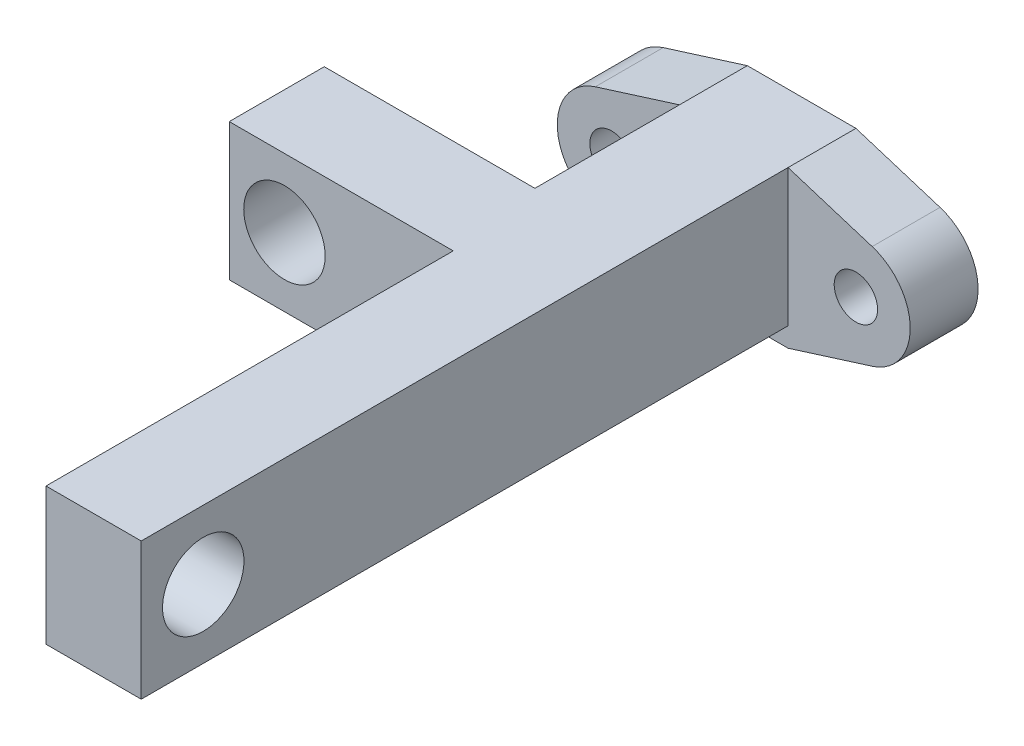
ISO-10303-21;
HEADER;
FILE_DESCRIPTION(('STEP AP214'),'2;1');
FILE_NAME('part.step','',(''),(''),'','','');
FILE_SCHEMA(('AUTOMOTIVE_DESIGN { 1 0 10303 214 1 1 1 1 }'));
ENDSEC;
DATA;
#1=APPLICATION_CONTEXT('core data for automotive mechanical design processes');
#2=APPLICATION_PROTOCOL_DEFINITION('international standard','automotive_design',2000,#1);
#3=PRODUCT_CONTEXT('',#1,'mechanical');
#4=PRODUCT('Part','Part','',(#3));
#5=PRODUCT_RELATED_PRODUCT_CATEGORY('part','',(#4));
#6=PRODUCT_DEFINITION_FORMATION('','',#4);
#7=PRODUCT_DEFINITION_CONTEXT('part definition',#1,'design');
#8=PRODUCT_DEFINITION('design','',#6,#7);
#9=PRODUCT_DEFINITION_SHAPE('','',#8);
#10=(LENGTH_UNIT() NAMED_UNIT(*) SI_UNIT(.MILLI.,.METRE.));
#11=(NAMED_UNIT(*) PLANE_ANGLE_UNIT() SI_UNIT($,.RADIAN.));
#12=(NAMED_UNIT(*) SI_UNIT($,.STERADIAN.) SOLID_ANGLE_UNIT());
#13=UNCERTAINTY_MEASURE_WITH_UNIT(LENGTH_MEASURE(1.E-05),#10,'distance_accuracy_value','');
#14=(GEOMETRIC_REPRESENTATION_CONTEXT(3) GLOBAL_UNCERTAINTY_ASSIGNED_CONTEXT((#13)) GLOBAL_UNIT_ASSIGNED_CONTEXT((#10,
#11,#12)) REPRESENTATION_CONTEXT('',''));
#15=CARTESIAN_POINT('',(0.,0.,0.));
#16=DIRECTION('',(0.,0.,1.));
#17=DIRECTION('',(1.,0.,0.));
#18=AXIS2_PLACEMENT_3D('',#15,#16,#17);
#19=CARTESIAN_POINT('',(-4.00000018998981,-4.33450474942276,22.6500000000004));
#20=DIRECTION('',(1.,0.,0.));
#21=DIRECTION('',(0.,0.,-1.));
#22=AXIS2_PLACEMENT_3D('',#19,#20,#21);
#23=PLANE('',#22);
#24=DIRECTION('',(0.,-1.,0.));
#25=VECTOR('',#24,1.);
#26=CARTESIAN_POINT('',(-4.00000018998981,5.76300080865621,15.6500000000005));
#27=LINE('',#26,#25);
#28=CARTESIAN_POINT('',(-4.00000018998981,5.76300080865621,15.6500000000005));
#29=VERTEX_POINT('',#28);
#30=CARTESIAN_POINT('',(-4.00000018998981,-4.33450474942276,15.6500000000005));
#31=VERTEX_POINT('',#30);
#32=EDGE_CURVE('E185',#29,#31,#27,.T.);
#33=ORIENTED_EDGE('',*,*,#32,.F.);
#34=DIRECTION('',(0.,0.,-1.));
#35=VECTOR('',#34,1.);
#36=CARTESIAN_POINT('',(-4.00000018998981,5.76300080865622,22.6500000000004));
#37=LINE('',#36,#35);
#38=CARTESIAN_POINT('',(-4.00000018998981,5.76300080865622,5.));
#39=VERTEX_POINT('',#38);
#40=EDGE_CURVE('E153',#29,#39,#37,.T.);
#41=ORIENTED_EDGE('',*,*,#40,.T.);
#42=DIRECTION('',(0.,-1.,0.));
#43=VECTOR('',#42,1.);
#44=CARTESIAN_POINT('',(-4.00000018998981,-4.33450474942276,5.));
#45=LINE('',#44,#43);
#46=CARTESIAN_POINT('',(-4.00000018998981,-4.33450474942276,5.));
#47=VERTEX_POINT('',#46);
#48=EDGE_CURVE('E209',#39,#47,#45,.T.);
#49=ORIENTED_EDGE('',*,*,#48,.T.);
#50=DIRECTION('',(0.,0.,-1.));
#51=VECTOR('',#50,1.);
#52=CARTESIAN_POINT('',(-4.00000018998981,-4.33450474942276,22.6500000000004));
#53=LINE('',#52,#51);
#54=EDGE_CURVE('E214',#31,#47,#53,.T.);
#55=ORIENTED_EDGE('',*,*,#54,.F.);
#56=EDGE_LOOP('',(#33,#41,#49,#55));
#57=FACE_BOUND('',#56,.T.);
#58=ADVANCED_FACE('F35',(#57),#23,.F.);
#59=CARTESIAN_POINT('',(-9.00014511895117,-0.00106902473267904,5.));
#60=DIRECTION('',(0.,0.,1.));
#61=DIRECTION('',(1.,0.,0.));
#62=AXIS2_PLACEMENT_3D('',#59,#60,#61);
#63=PLANE('',#62);
#64=DIRECTION('',(0.,1.,0.));
#65=VECTOR('',#64,1.);
#66=CARTESIAN_POINT('',(4.00000018998981,-4.33450474942276,5.));
#67=LINE('',#66,#65);
#68=CARTESIAN_POINT('',(4.00000018998981,-4.33450474942276,5.));
#69=VERTEX_POINT('',#68);
#70=CARTESIAN_POINT('',(4.00000018998981,5.76300080865622,5.));
#71=VERTEX_POINT('',#70);
#72=EDGE_CURVE('E59',#69,#71,#67,.T.);
#73=ORIENTED_EDGE('',*,*,#72,.F.);
#74=DIRECTION('',(1.,0.,0.));
#75=VECTOR('',#74,1.);
#76=CARTESIAN_POINT('',(4.00000018998981,-4.33450474942276,5.));
#77=LINE('',#76,#75);
#78=EDGE_CURVE('E205',#47,#69,#77,.T.);
#79=ORIENTED_EDGE('',*,*,#78,.F.);
#80=ORIENTED_EDGE('',*,*,#48,.F.);
#81=DIRECTION('',(-0.954029129539832,-0.299713896890804,0.));
#82=VECTOR('',#81,1.);
#83=CARTESIAN_POINT('',(-4.00000018998981,5.76300080865622,5.));
#84=LINE('',#83,#82);
#85=CARTESIAN_POINT('',(-10.1991438510935,3.8155031416285,5.));
#86=VERTEX_POINT('',#85);
#87=EDGE_CURVE('E243',#39,#86,#84,.T.);
#88=ORIENTED_EDGE('',*,*,#87,.T.);
#89=CARTESIAN_POINT('',(-9.00014511895117,-0.00106902473267904,5.));
#90=DIRECTION('',(0.,0.,1.));
#91=DIRECTION('',(1.,0.,0.));
#92=AXIS2_PLACEMENT_3D('',#89,#90,#91);
#93=CIRCLE('',#92,4.00047760407701);
#94=CARTESIAN_POINT('',(-10.1990659794877,-3.81766565404682,5.));
#95=VERTEX_POINT('',#94);
#96=EDGE_CURVE('E229',#86,#95,#93,.T.);
#97=ORIENTED_EDGE('',*,*,#96,.T.);
#98=DIRECTION('',(0.954035244547933,-0.299694431313572,0.));
#99=VECTOR('',#98,1.);
#100=CARTESIAN_POINT('',(-10.1990659794877,-3.81766565404682,5.));
#101=LINE('',#100,#99);
#102=CARTESIAN_POINT('',(-4.00000018998981,-5.76499989256263,5.));
#103=VERTEX_POINT('',#102);
#104=EDGE_CURVE('E232',#95,#103,#101,.T.);
#105=ORIENTED_EDGE('',*,*,#104,.T.);
#106=DIRECTION('',(1.,0.,0.));
#107=VECTOR('',#106,1.);
#108=CARTESIAN_POINT('',(-4.00000018998981,-5.76499989256263,5.));
#109=LINE('',#108,#107);
#110=CARTESIAN_POINT('',(4.00000018998981,-5.76499989256263,5.));
#111=VERTEX_POINT('',#110);
#112=EDGE_CURVE('E235',#103,#111,#109,.T.);
#113=ORIENTED_EDGE('',*,*,#112,.T.);
#114=DIRECTION('',(0.954001475587167,0.299801908895704,0.));
#115=VECTOR('',#114,1.);
#116=CARTESIAN_POINT('',(4.00000018998981,-5.76499989256263,5.));
#117=LINE('',#116,#115);
#118=CARTESIAN_POINT('',(10.1977820003338,-3.81730183840964,5.));
#119=VERTEX_POINT('',#118);
#120=EDGE_CURVE('E237',#111,#119,#117,.T.);
#121=ORIENTED_EDGE('',*,*,#120,.T.);
#122=CARTESIAN_POINT('',(8.99797345167928,0.000616233074978096,5.));
#123=DIRECTION('',(0.,0.,1.));
#124=DIRECTION('',(1.,0.,0.));
#125=AXIS2_PLACEMENT_3D('',#122,#123,#124);
#126=CIRCLE('',#125,4.00200436706325);
#127=CARTESIAN_POINT('',(10.1959695758342,3.81910339954591,5.));
#128=VERTEX_POINT('',#127);
#129=EDGE_CURVE('E239',#119,#128,#126,.T.);
#130=ORIENTED_EDGE('',*,*,#129,.T.);
#131=DIRECTION('',(-0.954143678077247,0.29934902970483,0.));
#132=VECTOR('',#131,1.);
#133=CARTESIAN_POINT('',(10.1959695758342,3.81910339954591,5.));
#134=LINE('',#133,#132);
#135=EDGE_CURVE('E241',#128,#71,#134,.T.);
#136=ORIENTED_EDGE('',*,*,#135,.T.);
#137=EDGE_LOOP('',(#73,#79,#80,#88,#97,#105,#113,#121,#130,#136));
#138=FACE_BOUND('',#137,.T.);
#139=CARTESIAN_POINT('',(8.99797345167928,0.000616233074978096,5.));
#140=DIRECTION('',(0.,0.,1.));
#141=DIRECTION('',(1.,0.,0.));
#142=AXIS2_PLACEMENT_3D('',#139,#140,#141);
#143=CIRCLE('',#142,1.59816028146403);
#144=CARTESIAN_POINT('',(10.5961337331433,0.000616233074978096,5.));
#145=VERTEX_POINT('',#144);
#146=EDGE_CURVE('E223',#145,#145,#143,.T.);
#147=ORIENTED_EDGE('',*,*,#146,.F.);
#148=EDGE_LOOP('',(#147));
#149=FACE_BOUND('',#148,.T.);
#150=CARTESIAN_POINT('',(-9.00014511895117,-0.00106902473267904,5.));
#151=DIRECTION('',(0.,0.,1.));
#152=DIRECTION('',(1.,0.,0.));
#153=AXIS2_PLACEMENT_3D('',#150,#151,#152);
#154=CIRCLE('',#153,1.60099342901495);
#155=CARTESIAN_POINT('',(-7.39915168993622,-0.00106902473267904,5.));
#156=VERTEX_POINT('',#155);
#157=EDGE_CURVE('E217',#156,#156,#154,.T.);
#158=ORIENTED_EDGE('',*,*,#157,.F.);
#159=EDGE_LOOP('',(#158));
#160=FACE_BOUND('',#159,.T.);
#161=ADVANCED_FACE('F301',(#138,#149,#160),#63,.T.);
#162=CARTESIAN_POINT('',(-9.00014511895117,-0.00106902473267904,0.));
#163=DIRECTION('',(0.,0.,1.));
#164=DIRECTION('',(1.,0.,0.));
#165=AXIS2_PLACEMENT_3D('',#162,#163,#164);
#166=PLANE('',#165);
#167=CARTESIAN_POINT('',(-9.00014511895117,-0.00106902473267904,0.));
#168=DIRECTION('',(0.,0.,1.));
#169=DIRECTION('',(1.,0.,0.));
#170=AXIS2_PLACEMENT_3D('',#167,#168,#169);
#171=CIRCLE('',#170,4.00047760407701);
#172=CARTESIAN_POINT('',(-10.1991438510935,3.8155031416285,0.));
#173=VERTEX_POINT('',#172);
#174=CARTESIAN_POINT('',(-10.1990659794877,-3.81766565404682,0.));
#175=VERTEX_POINT('',#174);
#176=EDGE_CURVE('E226',#173,#175,#171,.T.);
#177=ORIENTED_EDGE('',*,*,#176,.F.);
#178=DIRECTION('',(-0.954029129539832,-0.299713896890804,0.));
#179=VECTOR('',#178,1.);
#180=CARTESIAN_POINT('',(-4.00000018998981,5.76300080865622,0.));
#181=LINE('',#180,#179);
#182=CARTESIAN_POINT('',(-4.00000018998981,5.76300080865622,0.));
#183=VERTEX_POINT('',#182);
#184=EDGE_CURVE('E233',#183,#173,#181,.T.);
#185=ORIENTED_EDGE('',*,*,#184,.F.);
#186=DIRECTION('',(-1.,0.,0.));
#187=VECTOR('',#186,1.);
#188=CARTESIAN_POINT('',(4.00000018998981,5.76300080865622,0.));
#189=LINE('',#188,#187);
#190=CARTESIAN_POINT('',(4.00000018998981,5.76300080865622,0.));
#191=VERTEX_POINT('',#190);
#192=EDGE_CURVE('E258',#191,#183,#189,.T.);
#193=ORIENTED_EDGE('',*,*,#192,.F.);
#194=DIRECTION('',(-0.954143678077247,0.29934902970483,0.));
#195=VECTOR('',#194,1.);
#196=CARTESIAN_POINT('',(10.1959695758342,3.81910339954591,0.));
#197=LINE('',#196,#195);
#198=CARTESIAN_POINT('',(10.1959695758342,3.81910339954591,0.));
#199=VERTEX_POINT('',#198);
#200=EDGE_CURVE('E256',#199,#191,#197,.T.);
#201=ORIENTED_EDGE('',*,*,#200,.F.);
#202=CARTESIAN_POINT('',(8.99797345167928,0.000616233074978096,0.));
#203=DIRECTION('',(0.,0.,1.));
#204=DIRECTION('',(1.,0.,0.));
#205=AXIS2_PLACEMENT_3D('',#202,#203,#204);
#206=CIRCLE('',#205,4.00200436706325);
#207=CARTESIAN_POINT('',(10.1977820003338,-3.81730183840964,0.));
#208=VERTEX_POINT('',#207);
#209=EDGE_CURVE('E254',#208,#199,#206,.T.);
#210=ORIENTED_EDGE('',*,*,#209,.F.);
#211=DIRECTION('',(0.954001475587167,0.299801908895704,0.));
#212=VECTOR('',#211,1.);
#213=CARTESIAN_POINT('',(4.00000018998981,-5.76499989256263,0.));
#214=LINE('',#213,#212);
#215=CARTESIAN_POINT('',(4.00000018998981,-5.76499989256263,0.));
#216=VERTEX_POINT('',#215);
#217=EDGE_CURVE('E252',#216,#208,#214,.T.);
#218=ORIENTED_EDGE('',*,*,#217,.F.);
#219=DIRECTION('',(1.,0.,0.));
#220=VECTOR('',#219,1.);
#221=CARTESIAN_POINT('',(-4.00000018998981,-5.76499989256263,0.));
#222=LINE('',#221,#220);
#223=CARTESIAN_POINT('',(-4.00000018998981,-5.76499989256263,0.));
#224=VERTEX_POINT('',#223);
#225=EDGE_CURVE('E250',#224,#216,#222,.T.);
#226=ORIENTED_EDGE('',*,*,#225,.F.);
#227=DIRECTION('',(0.954035244547933,-0.299694431313572,0.));
#228=VECTOR('',#227,1.);
#229=CARTESIAN_POINT('',(-10.1990659794877,-3.81766565404682,0.));
#230=LINE('',#229,#228);
#231=EDGE_CURVE('E248',#175,#224,#230,.T.);
#232=ORIENTED_EDGE('',*,*,#231,.F.);
#233=EDGE_LOOP('',(#177,#185,#193,#201,#210,#218,#226,#232));
#234=FACE_BOUND('',#233,.T.);
#235=CARTESIAN_POINT('',(8.99797345167928,0.000616233074978096,0.));
#236=DIRECTION('',(0.,0.,1.));
#237=DIRECTION('',(1.,0.,0.));
#238=AXIS2_PLACEMENT_3D('',#235,#236,#237);
#239=CIRCLE('',#238,1.59816028146403);
#240=CARTESIAN_POINT('',(10.5961337331433,0.000616233074978096,0.));
#241=VERTEX_POINT('',#240);
#242=EDGE_CURVE('E220',#241,#241,#239,.T.);
#243=ORIENTED_EDGE('',*,*,#242,.T.);
#244=EDGE_LOOP('',(#243));
#245=FACE_BOUND('',#244,.T.);
#246=CARTESIAN_POINT('',(-9.00014511895117,-0.00106902473267904,0.));
#247=DIRECTION('',(0.,0.,1.));
#248=DIRECTION('',(1.,0.,0.));
#249=AXIS2_PLACEMENT_3D('',#246,#247,#248);
#250=CIRCLE('',#249,1.60099342901495);
#251=CARTESIAN_POINT('',(-7.39915168993622,-0.00106902473267904,0.));
#252=VERTEX_POINT('',#251);
#253=EDGE_CURVE('E152',#252,#252,#250,.T.);
#254=ORIENTED_EDGE('',*,*,#253,.T.);
#255=EDGE_LOOP('',(#254));
#256=FACE_BOUND('',#255,.T.);
#257=ADVANCED_FACE('F288',(#234,#245,#256),#166,.F.);
#258=CARTESIAN_POINT('',(-9.00014511895117,-0.00106902473267904,5.));
#259=DIRECTION('',(0.,0.,-1.));
#260=DIRECTION('',(-1.,0.,0.));
#261=AXIS2_PLACEMENT_3D('',#258,#259,#260);
#262=CYLINDRICAL_SURFACE('',#261,4.00047760407701);
#263=ORIENTED_EDGE('',*,*,#176,.T.);
#264=DIRECTION('',(0.,0.,-1.));
#265=VECTOR('',#264,1.);
#266=CARTESIAN_POINT('',(-10.1990659794877,-3.81766565404682,5.));
#267=LINE('',#266,#265);
#268=EDGE_CURVE('E11',#95,#175,#267,.T.);
#269=ORIENTED_EDGE('',*,*,#268,.F.);
#270=ORIENTED_EDGE('',*,*,#96,.F.);
#271=DIRECTION('',(0.,0.,-1.));
#272=VECTOR('',#271,1.);
#273=CARTESIAN_POINT('',(-10.1991438510935,3.8155031416285,5.));
#274=LINE('',#273,#272);
#275=EDGE_CURVE('E245',#86,#173,#274,.T.);
#276=ORIENTED_EDGE('',*,*,#275,.T.);
#277=EDGE_LOOP('',(#263,#269,#270,#276));
#278=FACE_BOUND('',#277,.T.);
#279=ADVANCED_FACE('F37',(#278),#262,.T.);
#280=CARTESIAN_POINT('',(-10.1990659794877,-3.81766565404682,5.));
#281=DIRECTION('',(0.299694431313572,0.954035244547933,0.));
#282=DIRECTION('',(-0.954035244547933,0.299694431313572,0.));
#283=AXIS2_PLACEMENT_3D('',#280,#281,#282);
#284=PLANE('',#283);
#285=ORIENTED_EDGE('',*,*,#231,.T.);
#286=DIRECTION('',(0.,0.,-1.));
#287=VECTOR('',#286,1.);
#288=CARTESIAN_POINT('',(-4.00000018998981,-5.76499989256263,5.));
#289=LINE('',#288,#287);
#290=EDGE_CURVE('E44',#103,#224,#289,.T.);
#291=ORIENTED_EDGE('',*,*,#290,.F.);
#292=ORIENTED_EDGE('',*,*,#104,.F.);
#293=ORIENTED_EDGE('',*,*,#268,.T.);
#294=EDGE_LOOP('',(#285,#291,#292,#293));
#295=FACE_BOUND('',#294,.T.);
#296=ADVANCED_FACE('F306',(#295),#284,.F.);
#297=CARTESIAN_POINT('',(-4.00000018998981,-5.76499989256263,5.));
#298=DIRECTION('',(0.,1.,0.));
#299=DIRECTION('',(0.,0.,1.));
#300=AXIS2_PLACEMENT_3D('',#297,#298,#299);
#301=PLANE('',#300);
#302=ORIENTED_EDGE('',*,*,#225,.T.);
#303=DIRECTION('',(0.,0.,-1.));
#304=VECTOR('',#303,1.);
#305=CARTESIAN_POINT('',(4.00000018998981,-5.76499989256263,5.));
#306=LINE('',#305,#304);
#307=EDGE_CURVE('E274',#111,#216,#306,.T.);
#308=ORIENTED_EDGE('',*,*,#307,.F.);
#309=ORIENTED_EDGE('',*,*,#112,.F.);
#310=ORIENTED_EDGE('',*,*,#290,.T.);
#311=EDGE_LOOP('',(#302,#308,#309,#310));
#312=FACE_BOUND('',#311,.T.);
#313=ADVANCED_FACE('F282',(#312),#301,.F.);
#314=CARTESIAN_POINT('',(4.00000018998981,-5.76499989256263,5.));
#315=DIRECTION('',(-0.299801908895704,0.954001475587167,0.));
#316=DIRECTION('',(-0.954001475587167,-0.299801908895704,0.));
#317=AXIS2_PLACEMENT_3D('',#314,#315,#316);
#318=PLANE('',#317);
#319=ORIENTED_EDGE('',*,*,#217,.T.);
#320=DIRECTION('',(0.,0.,-1.));
#321=VECTOR('',#320,1.);
#322=CARTESIAN_POINT('',(10.1977820003338,-3.81730183840964,5.));
#323=LINE('',#322,#321);
#324=EDGE_CURVE('E271',#119,#208,#323,.T.);
#325=ORIENTED_EDGE('',*,*,#324,.F.);
#326=ORIENTED_EDGE('',*,*,#120,.F.);
#327=ORIENTED_EDGE('',*,*,#307,.T.);
#328=EDGE_LOOP('',(#319,#325,#326,#327));
#329=FACE_BOUND('',#328,.T.);
#330=ADVANCED_FACE('F294',(#329),#318,.F.);
#331=CARTESIAN_POINT('',(8.99797345167928,0.000616233074978096,5.));
#332=DIRECTION('',(0.,0.,-1.));
#333=DIRECTION('',(-1.,0.,0.));
#334=AXIS2_PLACEMENT_3D('',#331,#332,#333);
#335=CYLINDRICAL_SURFACE('',#334,4.00200436706325);
#336=ORIENTED_EDGE('',*,*,#209,.T.);
#337=DIRECTION('',(0.,0.,-1.));
#338=VECTOR('',#337,1.);
#339=CARTESIAN_POINT('',(10.1959695758342,3.81910339954591,5.));
#340=LINE('',#339,#338);
#341=EDGE_CURVE('E268',#128,#199,#340,.T.);
#342=ORIENTED_EDGE('',*,*,#341,.F.);
#343=ORIENTED_EDGE('',*,*,#129,.F.);
#344=ORIENTED_EDGE('',*,*,#324,.T.);
#345=EDGE_LOOP('',(#336,#342,#343,#344));
#346=FACE_BOUND('',#345,.T.);
#347=ADVANCED_FACE('F298',(#346),#335,.T.);
#348=CARTESIAN_POINT('',(10.1959695758342,3.81910339954591,5.));
#349=DIRECTION('',(-0.29934902970483,-0.954143678077247,0.));
#350=DIRECTION('',(0.954143678077247,-0.29934902970483,0.));
#351=AXIS2_PLACEMENT_3D('',#348,#349,#350);
#352=PLANE('',#351);
#353=ORIENTED_EDGE('',*,*,#200,.T.);
#354=DIRECTION('',(0.,0.,-1.));
#355=VECTOR('',#354,1.);
#356=CARTESIAN_POINT('',(4.00000018998981,5.76300080865622,5.));
#357=LINE('',#356,#355);
#358=EDGE_CURVE('E266',#71,#191,#357,.T.);
#359=ORIENTED_EDGE('',*,*,#358,.F.);
#360=ORIENTED_EDGE('',*,*,#135,.F.);
#361=ORIENTED_EDGE('',*,*,#341,.T.);
#362=EDGE_LOOP('',(#353,#359,#360,#361));
#363=FACE_BOUND('',#362,.T.);
#364=ADVANCED_FACE('F318',(#363),#352,.F.);
#365=CARTESIAN_POINT('',(4.00000018998981,5.76300080865622,5.));
#366=DIRECTION('',(0.,-1.,0.));
#367=DIRECTION('',(0.,0.,-1.));
#368=AXIS2_PLACEMENT_3D('',#365,#366,#367);
#369=PLANE('',#368);
#370=ORIENTED_EDGE('',*,*,#192,.T.);
#371=DIRECTION('',(0.,0.,-1.));
#372=VECTOR('',#371,1.);
#373=CARTESIAN_POINT('',(-4.00000018998981,5.76300080865622,5.));
#374=LINE('',#373,#372);
#375=EDGE_CURVE('E263',#39,#183,#374,.T.);
#376=ORIENTED_EDGE('',*,*,#375,.F.);
#377=ORIENTED_EDGE('',*,*,#40,.F.);
#378=DIRECTION('',(1.,0.,0.));
#379=VECTOR('',#378,1.);
#380=CARTESIAN_POINT('',(-19.5157146095046,5.76300080865621,15.6500000000005));
#381=LINE('',#380,#379);
#382=CARTESIAN_POINT('',(-19.5157146095046,5.76300080865621,15.6500000000005));
#383=VERTEX_POINT('',#382);
#384=EDGE_CURVE('E200',#383,#29,#381,.T.);
#385=ORIENTED_EDGE('',*,*,#384,.F.);
#386=DIRECTION('',(0.,0.,-1.));
#387=VECTOR('',#386,1.);
#388=CARTESIAN_POINT('',(-19.5157146095046,5.76300080865622,22.6500000000004));
#389=LINE('',#388,#387);
#390=CARTESIAN_POINT('',(-19.5157146095046,5.76300080865622,22.6500000000004));
#391=VERTEX_POINT('',#390);
#392=EDGE_CURVE('E189',#391,#383,#389,.T.);
#393=ORIENTED_EDGE('',*,*,#392,.F.);
#394=DIRECTION('',(-1.,0.,0.));
#395=VECTOR('',#394,1.);
#396=CARTESIAN_POINT('',(4.00000018998981,5.76300080865622,22.6500000000004));
#397=LINE('',#396,#395);
#398=CARTESIAN_POINT('',(-3.01571460950542,5.76300080865622,22.6500000000004));
#399=VERTEX_POINT('',#398);
#400=EDGE_CURVE('E202',#399,#391,#397,.T.);
#401=ORIENTED_EDGE('',*,*,#400,.F.);
#402=DIRECTION('',(0.,0.,-1.));
#403=VECTOR('',#402,1.);
#404=CARTESIAN_POINT('',(-3.01571460950542,5.76300080865622,52.6500000000005));
#405=LINE('',#404,#403);
#406=CARTESIAN_POINT('',(-3.01571460950542,5.76300080865622,52.6500000000005));
#407=VERTEX_POINT('',#406);
#408=EDGE_CURVE('E159',#407,#399,#405,.T.);
#409=ORIENTED_EDGE('',*,*,#408,.F.);
#410=DIRECTION('',(-1.,0.,0.));
#411=VECTOR('',#410,1.);
#412=CARTESIAN_POINT('',(4.00000018998981,5.76300080865622,52.6500000000005));
#413=LINE('',#412,#411);
#414=CARTESIAN_POINT('',(4.00000018998981,5.76300080865622,52.6500000000005));
#415=VERTEX_POINT('',#414);
#416=EDGE_CURVE('E156',#415,#407,#413,.T.);
#417=ORIENTED_EDGE('',*,*,#416,.F.);
#418=DIRECTION('',(0.,0.,-1.));
#419=VECTOR('',#418,1.);
#420=CARTESIAN_POINT('',(4.00000018998981,5.76300080865622,22.6500000000004));
#421=LINE('',#420,#419);
#422=EDGE_CURVE('E144',#415,#71,#421,.T.);
#423=ORIENTED_EDGE('',*,*,#422,.T.);
#424=ORIENTED_EDGE('',*,*,#358,.T.);
#425=EDGE_LOOP('',(#370,#376,#377,#385,#393,#401,#409,#417,#423,#424));
#426=FACE_BOUND('',#425,.T.);
#427=ADVANCED_FACE('F157',(#426),#369,.F.);
#428=CARTESIAN_POINT('',(-4.00000018998981,5.76300080865622,5.));
#429=DIRECTION('',(0.299713896890804,-0.954029129539832,0.));
#430=DIRECTION('',(0.954029129539832,0.299713896890804,0.));
#431=AXIS2_PLACEMENT_3D('',#428,#429,#430);
#432=PLANE('',#431);
#433=ORIENTED_EDGE('',*,*,#184,.T.);
#434=ORIENTED_EDGE('',*,*,#275,.F.);
#435=ORIENTED_EDGE('',*,*,#87,.F.);
#436=ORIENTED_EDGE('',*,*,#375,.T.);
#437=EDGE_LOOP('',(#433,#434,#435,#436));
#438=FACE_BOUND('',#437,.T.);
#439=ADVANCED_FACE('F312',(#438),#432,.F.);
#440=CARTESIAN_POINT('',(8.99797345167928,0.000616233074978096,5.));
#441=DIRECTION('',(0.,0.,-1.));
#442=DIRECTION('',(-1.,0.,0.));
#443=AXIS2_PLACEMENT_3D('',#440,#441,#442);
#444=CYLINDRICAL_SURFACE('',#443,1.59816028146403);
#445=ORIENTED_EDGE('',*,*,#146,.T.);
#446=EDGE_LOOP('',(#445));
#447=FACE_BOUND('',#446,.T.);
#448=ORIENTED_EDGE('',*,*,#242,.F.);
#449=EDGE_LOOP('',(#448));
#450=FACE_BOUND('',#449,.T.);
#451=ADVANCED_FACE('F345',(#447,#450),#444,.F.);
#452=CARTESIAN_POINT('',(-9.00014511895117,-0.00106902473267904,5.));
#453=DIRECTION('',(0.,0.,-1.));
#454=DIRECTION('',(-1.,0.,0.));
#455=AXIS2_PLACEMENT_3D('',#452,#453,#454);
#456=CYLINDRICAL_SURFACE('',#455,1.60099342901495);
#457=ORIENTED_EDGE('',*,*,#157,.T.);
#458=EDGE_LOOP('',(#457));
#459=FACE_BOUND('',#458,.T.);
#460=ORIENTED_EDGE('',*,*,#253,.F.);
#461=EDGE_LOOP('',(#460));
#462=FACE_BOUND('',#461,.T.);
#463=ADVANCED_FACE('F341',(#459,#462),#456,.F.);
#464=CARTESIAN_POINT('',(4.00000018998981,-4.33450474942276,22.6500000000004));
#465=DIRECTION('',(-1.,0.,0.));
#466=DIRECTION('',(0.,0.,1.));
#467=AXIS2_PLACEMENT_3D('',#464,#465,#466);
#468=PLANE('',#467);
#469=CARTESIAN_POINT('',(4.00000018998981,0.714248029616726,48.0805543395636));
#470=DIRECTION('',(1.,0.,0.));
#471=DIRECTION('',(0.,0.,-1.));
#472=AXIS2_PLACEMENT_3D('',#469,#470,#471);
#473=CIRCLE('',#472,3.);
#474=CARTESIAN_POINT('',(4.00000018998981,0.714248029616726,45.0805543395636));
#475=VERTEX_POINT('',#474);
#476=EDGE_CURVE('E171',#475,#475,#473,.T.);
#477=ORIENTED_EDGE('',*,*,#476,.F.);
#478=EDGE_LOOP('',(#477));
#479=FACE_BOUND('',#478,.T.);
#480=ORIENTED_EDGE('',*,*,#72,.T.);
#481=ORIENTED_EDGE('',*,*,#422,.F.);
#482=DIRECTION('',(0.,1.,0.));
#483=VECTOR('',#482,1.);
#484=CARTESIAN_POINT('',(4.00000018998981,-4.33450474942276,52.6500000000005));
#485=LINE('',#484,#483);
#486=CARTESIAN_POINT('',(4.00000018998981,-4.33450474942276,52.6500000000005));
#487=VERTEX_POINT('',#486);
#488=EDGE_CURVE('E149',#487,#415,#485,.T.);
#489=ORIENTED_EDGE('',*,*,#488,.F.);
#490=DIRECTION('',(0.,0.,-1.));
#491=VECTOR('',#490,1.);
#492=CARTESIAN_POINT('',(4.00000018998981,-4.33450474942276,22.6500000000004));
#493=LINE('',#492,#491);
#494=EDGE_CURVE('E207',#487,#69,#493,.T.);
#495=ORIENTED_EDGE('',*,*,#494,.T.);
#496=EDGE_LOOP('',(#480,#481,#489,#495));
#497=FACE_BOUND('',#496,.T.);
#498=ADVANCED_FACE('F146',(#479,#497),#468,.F.);
#499=CARTESIAN_POINT('',(4.00000018998981,-4.33450474942276,22.6500000000004));
#500=DIRECTION('',(0.,1.,0.));
#501=DIRECTION('',(-1.,0.,0.));
#502=AXIS2_PLACEMENT_3D('',#499,#500,#501);
#503=PLANE('',#502);
#504=ORIENTED_EDGE('',*,*,#78,.T.);
#505=ORIENTED_EDGE('',*,*,#494,.F.);
#506=DIRECTION('',(1.,0.,0.));
#507=VECTOR('',#506,1.);
#508=CARTESIAN_POINT('',(4.00000018998981,-4.33450474942276,52.6500000000005));
#509=LINE('',#508,#507);
#510=CARTESIAN_POINT('',(-3.01571460950542,-4.33450474942276,52.6500000000005));
#511=VERTEX_POINT('',#510);
#512=EDGE_CURVE('E167',#511,#487,#509,.T.);
#513=ORIENTED_EDGE('',*,*,#512,.F.);
#514=DIRECTION('',(0.,0.,-1.));
#515=VECTOR('',#514,1.);
#516=CARTESIAN_POINT('',(-3.01571460950542,-4.33450474942276,52.6500000000005));
#517=LINE('',#516,#515);
#518=CARTESIAN_POINT('',(-3.01571460950542,-4.33450474942276,22.6500000000004));
#519=VERTEX_POINT('',#518);
#520=EDGE_CURVE('E174',#511,#519,#517,.T.);
#521=ORIENTED_EDGE('',*,*,#520,.T.);
#522=DIRECTION('',(1.,0.,0.));
#523=VECTOR('',#522,1.);
#524=CARTESIAN_POINT('',(4.00000018998981,-4.33450474942276,22.6500000000004));
#525=LINE('',#524,#523);
#526=CARTESIAN_POINT('',(-19.5157146095046,-4.33450474942276,22.6500000000004));
#527=VERTEX_POINT('',#526);
#528=EDGE_CURVE('E204',#527,#519,#525,.T.);
#529=ORIENTED_EDGE('',*,*,#528,.F.);
#530=DIRECTION('',(0.,0.,1.));
#531=VECTOR('',#530,1.);
#532=CARTESIAN_POINT('',(-19.5157146095046,-4.33450474942276,22.6500000000004));
#533=LINE('',#532,#531);
#534=CARTESIAN_POINT('',(-19.5157146095046,-4.33450474942276,15.6500000000005));
#535=VERTEX_POINT('',#534);
#536=EDGE_CURVE('E193',#535,#527,#533,.T.);
#537=ORIENTED_EDGE('',*,*,#536,.F.);
#538=DIRECTION('',(1.,0.,0.));
#539=VECTOR('',#538,1.);
#540=CARTESIAN_POINT('',(-19.5157146095046,-4.33450474942276,15.6500000000005));
#541=LINE('',#540,#539);
#542=EDGE_CURVE('E196',#535,#31,#541,.T.);
#543=ORIENTED_EDGE('',*,*,#542,.T.);
#544=ORIENTED_EDGE('',*,*,#54,.T.);
#545=EDGE_LOOP('',(#504,#505,#513,#521,#529,#537,#543,#544));
#546=FACE_BOUND('',#545,.T.);
#547=ADVANCED_FACE('F337',(#546),#503,.F.);
#548=CARTESIAN_POINT('',(0.,0.,22.6500000000004));
#549=DIRECTION('',(0.,0.,1.));
#550=DIRECTION('',(1.,0.,0.));
#551=AXIS2_PLACEMENT_3D('',#548,#549,#550);
#552=PLANE('',#551);
#553=DIRECTION('',(0.,-1.,0.));
#554=VECTOR('',#553,1.);
#555=CARTESIAN_POINT('',(-3.01571460950542,-4.33450474942276,22.6500000000004));
#556=LINE('',#555,#554);
#557=EDGE_CURVE('E51',#399,#519,#556,.T.);
#558=ORIENTED_EDGE('',*,*,#557,.F.);
#559=ORIENTED_EDGE('',*,*,#400,.T.);
#560=DIRECTION('',(0.,1.,0.));
#561=VECTOR('',#560,1.);
#562=CARTESIAN_POINT('',(-19.5157146095046,5.76300080865622,22.6500000000004));
#563=LINE('',#562,#561);
#564=EDGE_CURVE('E186',#527,#391,#563,.T.);
#565=ORIENTED_EDGE('',*,*,#564,.F.);
#566=ORIENTED_EDGE('',*,*,#528,.T.);
#567=EDGE_LOOP('',(#558,#559,#565,#566));
#568=FACE_BOUND('',#567,.T.);
#569=CARTESIAN_POINT('',(-15.4486873171786,0.714248029616725,22.6500000000004));
#570=DIRECTION('',(0.,0.,1.));
#571=DIRECTION('',(1.,0.,0.));
#572=AXIS2_PLACEMENT_3D('',#569,#570,#571);
#573=CIRCLE('',#572,3.);
#574=CARTESIAN_POINT('',(-12.4486873171786,0.714248029616725,22.6500000000004));
#575=VERTEX_POINT('',#574);
#576=EDGE_CURVE('E182',#575,#575,#573,.T.);
#577=ORIENTED_EDGE('',*,*,#576,.F.);
#578=EDGE_LOOP('',(#577));
#579=FACE_BOUND('',#578,.T.);
#580=ADVANCED_FACE('F379',(#568,#579),#552,.T.);
#581=CARTESIAN_POINT('',(-19.5157146095046,5.76300080865621,15.6500000000005));
#582=DIRECTION('',(0.,0.,1.));
#583=DIRECTION('',(1.,0.,0.));
#584=AXIS2_PLACEMENT_3D('',#581,#582,#583);
#585=PLANE('',#584);
#586=CARTESIAN_POINT('',(-15.4486873171786,0.714248029616725,15.6500000000005));
#587=DIRECTION('',(0.,0.,-1.));
#588=DIRECTION('',(-1.,0.,0.));
#589=AXIS2_PLACEMENT_3D('',#586,#587,#588);
#590=CIRCLE('',#589,3.);
#591=CARTESIAN_POINT('',(-18.4486873171786,0.714248029616725,15.6500000000005));
#592=VERTEX_POINT('',#591);
#593=EDGE_CURVE('E179',#592,#592,#590,.T.);
#594=ORIENTED_EDGE('',*,*,#593,.F.);
#595=EDGE_LOOP('',(#594));
#596=FACE_BOUND('',#595,.T.);
#597=ORIENTED_EDGE('',*,*,#32,.T.);
#598=ORIENTED_EDGE('',*,*,#542,.F.);
#599=DIRECTION('',(0.,-1.,0.));
#600=VECTOR('',#599,1.);
#601=CARTESIAN_POINT('',(-19.5157146095046,5.76300080865621,15.6500000000005));
#602=LINE('',#601,#600);
#603=EDGE_CURVE('E191',#383,#535,#602,.T.);
#604=ORIENTED_EDGE('',*,*,#603,.F.);
#605=ORIENTED_EDGE('',*,*,#384,.T.);
#606=EDGE_LOOP('',(#597,#598,#604,#605));
#607=FACE_BOUND('',#606,.T.);
#608=ADVANCED_FACE('F386',(#596,#607),#585,.F.);
#609=CARTESIAN_POINT('',(-19.5157146095046,0.,0.));
#610=DIRECTION('',(1.,0.,0.));
#611=DIRECTION('',(0.,0.,-1.));
#612=AXIS2_PLACEMENT_3D('',#609,#610,#611);
#613=PLANE('',#612);
#614=ORIENTED_EDGE('',*,*,#564,.T.);
#615=ORIENTED_EDGE('',*,*,#392,.T.);
#616=ORIENTED_EDGE('',*,*,#603,.T.);
#617=ORIENTED_EDGE('',*,*,#536,.T.);
#618=EDGE_LOOP('',(#614,#615,#616,#617));
#619=FACE_BOUND('',#618,.T.);
#620=ADVANCED_FACE('F392',(#619),#613,.F.);
#621=CARTESIAN_POINT('',(-15.4486873171786,0.714248029616725,28.6500000000005));
#622=DIRECTION('',(0.,0.,-1.));
#623=DIRECTION('',(-1.,0.,0.));
#624=AXIS2_PLACEMENT_3D('',#621,#622,#623);
#625=CYLINDRICAL_SURFACE('',#624,3.);
#626=ORIENTED_EDGE('',*,*,#576,.T.);
#627=EDGE_LOOP('',(#626));
#628=FACE_BOUND('',#627,.T.);
#629=ORIENTED_EDGE('',*,*,#593,.T.);
#630=EDGE_LOOP('',(#629));
#631=FACE_BOUND('',#630,.T.);
#632=ADVANCED_FACE('F401',(#628,#631),#625,.F.);
#633=CARTESIAN_POINT('',(-3.01571460950542,-4.33450474942276,52.6500000000005));
#634=DIRECTION('',(1.,0.,0.));
#635=DIRECTION('',(0.,0.,-1.));
#636=AXIS2_PLACEMENT_3D('',#633,#634,#635);
#637=PLANE('',#636);
#638=CARTESIAN_POINT('',(-3.01571460950542,0.714248029616726,48.0805543395636));
#639=DIRECTION('',(1.,0.,0.));
#640=DIRECTION('',(0.,0.,-1.));
#641=AXIS2_PLACEMENT_3D('',#638,#639,#640);
#642=CIRCLE('',#641,3.);
#643=CARTESIAN_POINT('',(-3.01571460950542,0.714248029616726,45.0805543395636));
#644=VERTEX_POINT('',#643);
#645=EDGE_CURVE('E39',#644,#644,#642,.T.);
#646=ORIENTED_EDGE('',*,*,#645,.T.);
#647=EDGE_LOOP('',(#646));
#648=FACE_BOUND('',#647,.T.);
#649=ORIENTED_EDGE('',*,*,#557,.T.);
#650=ORIENTED_EDGE('',*,*,#520,.F.);
#651=DIRECTION('',(0.,-1.,0.));
#652=VECTOR('',#651,1.);
#653=CARTESIAN_POINT('',(-3.01571460950542,-4.33450474942276,52.6500000000005));
#654=LINE('',#653,#652);
#655=EDGE_CURVE('E162',#407,#511,#654,.T.);
#656=ORIENTED_EDGE('',*,*,#655,.F.);
#657=ORIENTED_EDGE('',*,*,#408,.T.);
#658=EDGE_LOOP('',(#649,#650,#656,#657));
#659=FACE_BOUND('',#658,.T.);
#660=ADVANCED_FACE('F408',(#648,#659),#637,.F.);
#661=CARTESIAN_POINT('',(0.,0.,52.6500000000005));
#662=DIRECTION('',(0.,0.,1.));
#663=DIRECTION('',(1.,0.,0.));
#664=AXIS2_PLACEMENT_3D('',#661,#662,#663);
#665=PLANE('',#664);
#666=ORIENTED_EDGE('',*,*,#488,.T.);
#667=ORIENTED_EDGE('',*,*,#416,.T.);
#668=ORIENTED_EDGE('',*,*,#655,.T.);
#669=ORIENTED_EDGE('',*,*,#512,.T.);
#670=EDGE_LOOP('',(#666,#667,#668,#669));
#671=FACE_BOUND('',#670,.T.);
#672=ADVANCED_FACE('F165',(#671),#665,.T.);
#673=CARTESIAN_POINT('',(-25.9999998100102,0.714248029616726,48.0805543395636));
#674=DIRECTION('',(1.,0.,0.));
#675=DIRECTION('',(0.,0.,-1.));
#676=AXIS2_PLACEMENT_3D('',#673,#674,#675);
#677=CYLINDRICAL_SURFACE('',#676,3.);
#678=ORIENTED_EDGE('',*,*,#476,.T.);
#679=EDGE_LOOP('',(#678));
#680=FACE_BOUND('',#679,.T.);
#681=ORIENTED_EDGE('',*,*,#645,.F.);
#682=EDGE_LOOP('',(#681));
#683=FACE_BOUND('',#682,.T.);
#684=ADVANCED_FACE('F422',(#680,#683),#677,.F.);
#685=CLOSED_SHELL('',(#58,#161,#257,#279,#296,#313,#330,#347,#364,#427,#439,#451,#463,#498,#547,
#580,#608,#620,#632,#660,#672,#684));
#686=MANIFOLD_SOLID_BREP('B2',#685);
#687=ADVANCED_BREP_SHAPE_REPRESENTATION('',(#18,#686),#14);
#688=SHAPE_DEFINITION_REPRESENTATION(#9,#687);
ENDSEC;
END-ISO-10303-21;
